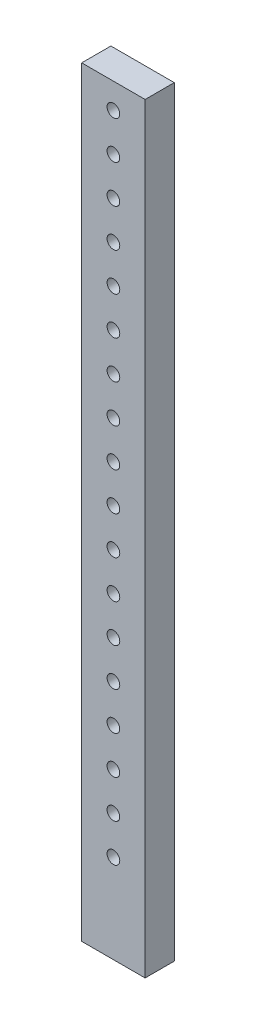
ISO-10303-21;
HEADER;
FILE_DESCRIPTION(('STEP AP214'),'2;1');
FILE_NAME('part.step','',(''),(''),'','','');
FILE_SCHEMA(('AUTOMOTIVE_DESIGN { 1 0 10303 214 1 1 1 1 }'));
ENDSEC;
DATA;
#1=APPLICATION_CONTEXT('core data for automotive mechanical design processes');
#2=APPLICATION_PROTOCOL_DEFINITION('international standard','automotive_design',2000,#1);
#3=PRODUCT_CONTEXT('',#1,'mechanical');
#4=PRODUCT('Part','Part','',(#3));
#5=PRODUCT_RELATED_PRODUCT_CATEGORY('part','',(#4));
#6=PRODUCT_DEFINITION_FORMATION('','',#4);
#7=PRODUCT_DEFINITION_CONTEXT('part definition',#1,'design');
#8=PRODUCT_DEFINITION('design','',#6,#7);
#9=PRODUCT_DEFINITION_SHAPE('','',#8);
#10=(LENGTH_UNIT() NAMED_UNIT(*) SI_UNIT(.MILLI.,.METRE.));
#11=(NAMED_UNIT(*) PLANE_ANGLE_UNIT() SI_UNIT($,.RADIAN.));
#12=(NAMED_UNIT(*) SI_UNIT($,.STERADIAN.) SOLID_ANGLE_UNIT());
#13=UNCERTAINTY_MEASURE_WITH_UNIT(LENGTH_MEASURE(1.E-05),#10,'distance_accuracy_value','');
#14=(GEOMETRIC_REPRESENTATION_CONTEXT(3) GLOBAL_UNCERTAINTY_ASSIGNED_CONTEXT((#13)) GLOBAL_UNIT_ASSIGNED_CONTEXT((#10,
#11,#12)) REPRESENTATION_CONTEXT('',''));
#15=CARTESIAN_POINT('',(0.,0.,0.));
#16=DIRECTION('',(0.,0.,1.));
#17=DIRECTION('',(1.,0.,0.));
#18=AXIS2_PLACEMENT_3D('',#15,#16,#17);
#19=CARTESIAN_POINT('',(0.,0.,23.));
#20=DIRECTION('',(0.,0.,1.));
#21=DIRECTION('',(1.,0.,0.));
#22=AXIS2_PLACEMENT_3D('',#19,#20,#21);
#23=PLANE('',#22);
#24=CARTESIAN_POINT('',(6.74691348156617E-12,-200.,23.));
#25=DIRECTION('',(0.,0.,1.));
#26=DIRECTION('',(1.,0.,0.));
#27=AXIS2_PLACEMENT_3D('',#24,#25,#26);
#28=CIRCLE('',#27,5.);
#29=CARTESIAN_POINT('',(5.00000000000675,-200.,23.));
#30=VERTEX_POINT('',#29);
#31=EDGE_CURVE('E204',#30,#30,#28,.T.);
#32=ORIENTED_EDGE('',*,*,#31,.F.);
#33=EDGE_LOOP('',(#32));
#34=FACE_BOUND('',#33,.T.);
#35=CARTESIAN_POINT('',(5.90528401984637E-12,-140.,23.));
#36=DIRECTION('',(0.,0.,1.));
#37=DIRECTION('',(1.,0.,0.));
#38=AXIS2_PLACEMENT_3D('',#35,#36,#37);
#39=CIRCLE('',#38,5.);
#40=CARTESIAN_POINT('',(5.00000000000591,-140.,23.));
#41=VERTEX_POINT('',#40);
#42=EDGE_CURVE('E192',#41,#41,#39,.T.);
#43=ORIENTED_EDGE('',*,*,#42,.F.);
#44=EDGE_LOOP('',(#43));
#45=FACE_BOUND('',#44,.T.);
#46=CARTESIAN_POINT('',(5.06365455812658E-12,-80.,23.));
#47=DIRECTION('',(0.,0.,1.));
#48=DIRECTION('',(1.,0.,0.));
#49=AXIS2_PLACEMENT_3D('',#46,#47,#48);
#50=CIRCLE('',#49,5.);
#51=CARTESIAN_POINT('',(5.00000000000507,-80.,23.));
#52=VERTEX_POINT('',#51);
#53=EDGE_CURVE('E180',#52,#52,#50,.T.);
#54=ORIENTED_EDGE('',*,*,#53,.F.);
#55=EDGE_LOOP('',(#54));
#56=FACE_BOUND('',#55,.T.);
#57=CARTESIAN_POINT('',(4.22202509640678E-12,-20.,23.));
#58=DIRECTION('',(0.,0.,1.));
#59=DIRECTION('',(1.,0.,0.));
#60=AXIS2_PLACEMENT_3D('',#57,#58,#59);
#61=CIRCLE('',#60,5.);
#62=CARTESIAN_POINT('',(5.00000000000423,-20.,23.));
#63=VERTEX_POINT('',#62);
#64=EDGE_CURVE('E168',#63,#63,#61,.T.);
#65=ORIENTED_EDGE('',*,*,#64,.F.);
#66=EDGE_LOOP('',(#65));
#67=FACE_BOUND('',#66,.T.);
#68=CARTESIAN_POINT('',(3.38039563468699E-12,40.,23.));
#69=DIRECTION('',(0.,0.,1.));
#70=DIRECTION('',(1.,0.,0.));
#71=AXIS2_PLACEMENT_3D('',#68,#69,#70);
#72=CIRCLE('',#71,5.);
#73=CARTESIAN_POINT('',(5.00000000000338,40.,23.));
#74=VERTEX_POINT('',#73);
#75=EDGE_CURVE('E156',#74,#74,#72,.T.);
#76=ORIENTED_EDGE('',*,*,#75,.F.);
#77=EDGE_LOOP('',(#76));
#78=FACE_BOUND('',#77,.T.);
#79=CARTESIAN_POINT('',(2.5387661729672E-12,100.,23.));
#80=DIRECTION('',(0.,0.,1.));
#81=DIRECTION('',(1.,0.,0.));
#82=AXIS2_PLACEMENT_3D('',#79,#80,#81);
#83=CIRCLE('',#82,5.);
#84=CARTESIAN_POINT('',(5.00000000000254,100.,23.));
#85=VERTEX_POINT('',#84);
#86=EDGE_CURVE('E144',#85,#85,#83,.T.);
#87=ORIENTED_EDGE('',*,*,#86,.F.);
#88=EDGE_LOOP('',(#87));
#89=FACE_BOUND('',#88,.T.);
#90=CARTESIAN_POINT('',(1.6971367112474E-12,160.,23.));
#91=DIRECTION('',(0.,0.,1.));
#92=DIRECTION('',(1.,0.,0.));
#93=AXIS2_PLACEMENT_3D('',#90,#91,#92);
#94=CIRCLE('',#93,5.);
#95=CARTESIAN_POINT('',(5.0000000000017,160.,23.));
#96=VERTEX_POINT('',#95);
#97=EDGE_CURVE('E132',#96,#96,#94,.T.);
#98=ORIENTED_EDGE('',*,*,#97,.F.);
#99=EDGE_LOOP('',(#98));
#100=FACE_BOUND('',#99,.T.);
#101=CARTESIAN_POINT('',(8.55507249527608E-13,220.,23.));
#102=DIRECTION('',(0.,0.,1.));
#103=DIRECTION('',(1.,0.,0.));
#104=AXIS2_PLACEMENT_3D('',#101,#102,#103);
#105=CIRCLE('',#104,5.);
#106=CARTESIAN_POINT('',(5.00000000000086,220.,23.));
#107=VERTEX_POINT('',#106);
#108=EDGE_CURVE('E120',#107,#107,#105,.T.);
#109=ORIENTED_EDGE('',*,*,#108,.F.);
#110=EDGE_LOOP('',(#109));
#111=FACE_BOUND('',#110,.T.);
#112=CARTESIAN_POINT('',(0.,280.,23.));
#113=DIRECTION('',(0.,0.,1.));
#114=DIRECTION('',(1.,0.,0.));
#115=AXIS2_PLACEMENT_3D('',#112,#113,#114);
#116=CIRCLE('',#115,5.);
#117=CARTESIAN_POINT('',(5.00000000000002,280.,23.));
#118=VERTEX_POINT('',#117);
#119=EDGE_CURVE('E99',#118,#118,#116,.T.);
#120=ORIENTED_EDGE('',*,*,#119,.F.);
#121=EDGE_LOOP('',(#120));
#122=FACE_BOUND('',#121,.T.);
#123=DIRECTION('',(0.,1.,0.));
#124=VECTOR('',#123,1.);
#125=CARTESIAN_POINT('',(25.,300.,23.));
#126=LINE('',#125,#124);
#127=CARTESIAN_POINT('',(25.,-300.,23.));
#128=VERTEX_POINT('',#127);
#129=CARTESIAN_POINT('',(25.,300.,23.));
#130=VERTEX_POINT('',#129);
#131=EDGE_CURVE('E84',#128,#130,#126,.T.);
#132=ORIENTED_EDGE('',*,*,#131,.T.);
#133=DIRECTION('',(-1.,0.,0.));
#134=VECTOR('',#133,1.);
#135=CARTESIAN_POINT('',(-25.,300.,23.));
#136=LINE('',#135,#134);
#137=CARTESIAN_POINT('',(-25.,300.,23.));
#138=VERTEX_POINT('',#137);
#139=EDGE_CURVE('E79',#130,#138,#136,.T.);
#140=ORIENTED_EDGE('',*,*,#139,.T.);
#141=DIRECTION('',(0.,-1.,0.));
#142=VECTOR('',#141,1.);
#143=CARTESIAN_POINT('',(-25.,300.,23.));
#144=LINE('',#143,#142);
#145=CARTESIAN_POINT('',(-25.,-300.,23.));
#146=VERTEX_POINT('',#145);
#147=EDGE_CURVE('E82',#138,#146,#144,.T.);
#148=ORIENTED_EDGE('',*,*,#147,.T.);
#149=DIRECTION('',(1.,0.,0.));
#150=VECTOR('',#149,1.);
#151=CARTESIAN_POINT('',(-25.,-300.,23.));
#152=LINE('',#151,#150);
#153=EDGE_CURVE('E49',#146,#128,#152,.T.);
#154=ORIENTED_EDGE('',*,*,#153,.T.);
#155=EDGE_LOOP('',(#132,#140,#148,#154));
#156=FACE_BOUND('',#155,.T.);
#157=CARTESIAN_POINT('',(4.34692518667711E-13,250.,23.));
#158=DIRECTION('',(0.,0.,1.));
#159=DIRECTION('',(1.,0.,0.));
#160=AXIS2_PLACEMENT_3D('',#157,#158,#159);
#161=CIRCLE('',#160,5.);
#162=CARTESIAN_POINT('',(5.00000000000043,250.,23.));
#163=VERTEX_POINT('',#162);
#164=EDGE_CURVE('E114',#163,#163,#161,.T.);
#165=ORIENTED_EDGE('',*,*,#164,.F.);
#166=EDGE_LOOP('',(#165));
#167=FACE_BOUND('',#166,.T.);
#168=CARTESIAN_POINT('',(1.27632198038751E-12,190.,23.));
#169=DIRECTION('',(0.,0.,1.));
#170=DIRECTION('',(1.,0.,0.));
#171=AXIS2_PLACEMENT_3D('',#168,#169,#170);
#172=CIRCLE('',#171,5.);
#173=CARTESIAN_POINT('',(5.00000000000128,190.,23.));
#174=VERTEX_POINT('',#173);
#175=EDGE_CURVE('E126',#174,#174,#172,.T.);
#176=ORIENTED_EDGE('',*,*,#175,.F.);
#177=EDGE_LOOP('',(#176));
#178=FACE_BOUND('',#177,.T.);
#179=CARTESIAN_POINT('',(2.1179514421073E-12,130.,23.));
#180=DIRECTION('',(0.,0.,1.));
#181=DIRECTION('',(1.,0.,0.));
#182=AXIS2_PLACEMENT_3D('',#179,#180,#181);
#183=CIRCLE('',#182,5.);
#184=CARTESIAN_POINT('',(5.00000000000212,130.,23.));
#185=VERTEX_POINT('',#184);
#186=EDGE_CURVE('E138',#185,#185,#183,.T.);
#187=ORIENTED_EDGE('',*,*,#186,.F.);
#188=EDGE_LOOP('',(#187));
#189=FACE_BOUND('',#188,.T.);
#190=CARTESIAN_POINT('',(2.95958090382709E-12,70.,23.));
#191=DIRECTION('',(0.,0.,1.));
#192=DIRECTION('',(1.,0.,0.));
#193=AXIS2_PLACEMENT_3D('',#190,#191,#192);
#194=CIRCLE('',#193,5.);
#195=CARTESIAN_POINT('',(5.00000000000296,70.,23.));
#196=VERTEX_POINT('',#195);
#197=EDGE_CURVE('E150',#196,#196,#194,.T.);
#198=ORIENTED_EDGE('',*,*,#197,.F.);
#199=EDGE_LOOP('',(#198));
#200=FACE_BOUND('',#199,.T.);
#201=CARTESIAN_POINT('',(3.80121036554689E-12,10.,23.));
#202=DIRECTION('',(0.,0.,1.));
#203=DIRECTION('',(1.,0.,0.));
#204=AXIS2_PLACEMENT_3D('',#201,#202,#203);
#205=CIRCLE('',#204,5.);
#206=CARTESIAN_POINT('',(5.0000000000038,10.,23.));
#207=VERTEX_POINT('',#206);
#208=EDGE_CURVE('E162',#207,#207,#205,.T.);
#209=ORIENTED_EDGE('',*,*,#208,.F.);
#210=EDGE_LOOP('',(#209));
#211=FACE_BOUND('',#210,.T.);
#212=CARTESIAN_POINT('',(4.64283982726668E-12,-50.,23.));
#213=DIRECTION('',(0.,0.,1.));
#214=DIRECTION('',(1.,0.,0.));
#215=AXIS2_PLACEMENT_3D('',#212,#213,#214);
#216=CIRCLE('',#215,5.);
#217=CARTESIAN_POINT('',(5.00000000000465,-50.,23.));
#218=VERTEX_POINT('',#217);
#219=EDGE_CURVE('E174',#218,#218,#216,.T.);
#220=ORIENTED_EDGE('',*,*,#219,.F.);
#221=EDGE_LOOP('',(#220));
#222=FACE_BOUND('',#221,.T.);
#223=CARTESIAN_POINT('',(5.48446928898647E-12,-110.,23.));
#224=DIRECTION('',(0.,0.,1.));
#225=DIRECTION('',(1.,0.,0.));
#226=AXIS2_PLACEMENT_3D('',#223,#224,#225);
#227=CIRCLE('',#226,5.);
#228=CARTESIAN_POINT('',(5.00000000000549,-110.,23.));
#229=VERTEX_POINT('',#228);
#230=EDGE_CURVE('E186',#229,#229,#227,.T.);
#231=ORIENTED_EDGE('',*,*,#230,.F.);
#232=EDGE_LOOP('',(#231));
#233=FACE_BOUND('',#232,.T.);
#234=CARTESIAN_POINT('',(6.32609875070627E-12,-170.,23.));
#235=DIRECTION('',(0.,0.,1.));
#236=DIRECTION('',(1.,0.,0.));
#237=AXIS2_PLACEMENT_3D('',#234,#235,#236);
#238=CIRCLE('',#237,5.);
#239=CARTESIAN_POINT('',(5.00000000000633,-170.,23.));
#240=VERTEX_POINT('',#239);
#241=EDGE_CURVE('E198',#240,#240,#238,.T.);
#242=ORIENTED_EDGE('',*,*,#241,.F.);
#243=EDGE_LOOP('',(#242));
#244=FACE_BOUND('',#243,.T.);
#245=CARTESIAN_POINT('',(7.16772821242606E-12,-230.,23.));
#246=DIRECTION('',(0.,0.,1.));
#247=DIRECTION('',(1.,0.,0.));
#248=AXIS2_PLACEMENT_3D('',#245,#246,#247);
#249=CIRCLE('',#248,5.);
#250=CARTESIAN_POINT('',(5.00000000000717,-230.,23.));
#251=VERTEX_POINT('',#250);
#252=EDGE_CURVE('E210',#251,#251,#249,.T.);
#253=ORIENTED_EDGE('',*,*,#252,.F.);
#254=EDGE_LOOP('',(#253));
#255=FACE_BOUND('',#254,.T.);
#256=ADVANCED_FACE('F32',(#34,#45,#56,#67,#78,#89,#100,#111,#122,#156,#167,#178,#189,#200,#211,
#222,#233,#244,#255),#23,.T.);
#257=CARTESIAN_POINT('',(0.,0.,0.));
#258=DIRECTION('',(0.,0.,1.));
#259=DIRECTION('',(1.,0.,0.));
#260=AXIS2_PLACEMENT_3D('',#257,#258,#259);
#261=PLANE('',#260);
#262=CARTESIAN_POINT('',(6.74691348156617E-12,-200.,0.));
#263=DIRECTION('',(0.,0.,1.));
#264=DIRECTION('',(1.,0.,0.));
#265=AXIS2_PLACEMENT_3D('',#262,#263,#264);
#266=CIRCLE('',#265,5.);
#267=CARTESIAN_POINT('',(5.00000000000675,-200.,0.));
#268=VERTEX_POINT('',#267);
#269=EDGE_CURVE('E207',#268,#268,#266,.T.);
#270=ORIENTED_EDGE('',*,*,#269,.T.);
#271=EDGE_LOOP('',(#270));
#272=FACE_BOUND('',#271,.T.);
#273=CARTESIAN_POINT('',(5.90528401984637E-12,-140.,0.));
#274=DIRECTION('',(0.,0.,1.));
#275=DIRECTION('',(1.,0.,0.));
#276=AXIS2_PLACEMENT_3D('',#273,#274,#275);
#277=CIRCLE('',#276,5.);
#278=CARTESIAN_POINT('',(5.00000000000591,-140.,0.));
#279=VERTEX_POINT('',#278);
#280=EDGE_CURVE('E195',#279,#279,#277,.T.);
#281=ORIENTED_EDGE('',*,*,#280,.T.);
#282=EDGE_LOOP('',(#281));
#283=FACE_BOUND('',#282,.T.);
#284=CARTESIAN_POINT('',(5.06365455812658E-12,-80.,0.));
#285=DIRECTION('',(0.,0.,1.));
#286=DIRECTION('',(1.,0.,0.));
#287=AXIS2_PLACEMENT_3D('',#284,#285,#286);
#288=CIRCLE('',#287,5.);
#289=CARTESIAN_POINT('',(5.00000000000507,-80.,0.));
#290=VERTEX_POINT('',#289);
#291=EDGE_CURVE('E183',#290,#290,#288,.T.);
#292=ORIENTED_EDGE('',*,*,#291,.T.);
#293=EDGE_LOOP('',(#292));
#294=FACE_BOUND('',#293,.T.);
#295=CARTESIAN_POINT('',(4.22202509640678E-12,-20.,0.));
#296=DIRECTION('',(0.,0.,1.));
#297=DIRECTION('',(1.,0.,0.));
#298=AXIS2_PLACEMENT_3D('',#295,#296,#297);
#299=CIRCLE('',#298,5.);
#300=CARTESIAN_POINT('',(5.00000000000423,-20.,0.));
#301=VERTEX_POINT('',#300);
#302=EDGE_CURVE('E171',#301,#301,#299,.T.);
#303=ORIENTED_EDGE('',*,*,#302,.T.);
#304=EDGE_LOOP('',(#303));
#305=FACE_BOUND('',#304,.T.);
#306=CARTESIAN_POINT('',(3.38039563468699E-12,40.,0.));
#307=DIRECTION('',(0.,0.,1.));
#308=DIRECTION('',(1.,0.,0.));
#309=AXIS2_PLACEMENT_3D('',#306,#307,#308);
#310=CIRCLE('',#309,5.);
#311=CARTESIAN_POINT('',(5.00000000000338,40.,0.));
#312=VERTEX_POINT('',#311);
#313=EDGE_CURVE('E159',#312,#312,#310,.T.);
#314=ORIENTED_EDGE('',*,*,#313,.T.);
#315=EDGE_LOOP('',(#314));
#316=FACE_BOUND('',#315,.T.);
#317=CARTESIAN_POINT('',(2.5387661729672E-12,100.,0.));
#318=DIRECTION('',(0.,0.,1.));
#319=DIRECTION('',(1.,0.,0.));
#320=AXIS2_PLACEMENT_3D('',#317,#318,#319);
#321=CIRCLE('',#320,5.);
#322=CARTESIAN_POINT('',(5.00000000000254,100.,0.));
#323=VERTEX_POINT('',#322);
#324=EDGE_CURVE('E147',#323,#323,#321,.T.);
#325=ORIENTED_EDGE('',*,*,#324,.T.);
#326=EDGE_LOOP('',(#325));
#327=FACE_BOUND('',#326,.T.);
#328=CARTESIAN_POINT('',(1.6971367112474E-12,160.,0.));
#329=DIRECTION('',(0.,0.,1.));
#330=DIRECTION('',(1.,0.,0.));
#331=AXIS2_PLACEMENT_3D('',#328,#329,#330);
#332=CIRCLE('',#331,5.);
#333=CARTESIAN_POINT('',(5.0000000000017,160.,0.));
#334=VERTEX_POINT('',#333);
#335=EDGE_CURVE('E135',#334,#334,#332,.T.);
#336=ORIENTED_EDGE('',*,*,#335,.T.);
#337=EDGE_LOOP('',(#336));
#338=FACE_BOUND('',#337,.T.);
#339=CARTESIAN_POINT('',(8.55507249527608E-13,220.,0.));
#340=DIRECTION('',(0.,0.,1.));
#341=DIRECTION('',(1.,0.,0.));
#342=AXIS2_PLACEMENT_3D('',#339,#340,#341);
#343=CIRCLE('',#342,5.);
#344=CARTESIAN_POINT('',(5.00000000000086,220.,0.));
#345=VERTEX_POINT('',#344);
#346=EDGE_CURVE('E123',#345,#345,#343,.T.);
#347=ORIENTED_EDGE('',*,*,#346,.T.);
#348=EDGE_LOOP('',(#347));
#349=FACE_BOUND('',#348,.T.);
#350=CARTESIAN_POINT('',(0.,280.,0.));
#351=DIRECTION('',(0.,0.,1.));
#352=DIRECTION('',(1.,0.,0.));
#353=AXIS2_PLACEMENT_3D('',#350,#351,#352);
#354=CIRCLE('',#353,5.);
#355=CARTESIAN_POINT('',(5.00000000000002,280.,0.));
#356=VERTEX_POINT('',#355);
#357=EDGE_CURVE('E111',#356,#356,#354,.T.);
#358=ORIENTED_EDGE('',*,*,#357,.T.);
#359=EDGE_LOOP('',(#358));
#360=FACE_BOUND('',#359,.T.);
#361=DIRECTION('',(0.,1.,0.));
#362=VECTOR('',#361,1.);
#363=CARTESIAN_POINT('',(25.,300.,0.));
#364=LINE('',#363,#362);
#365=CARTESIAN_POINT('',(25.,-300.,0.));
#366=VERTEX_POINT('',#365);
#367=CARTESIAN_POINT('',(25.,300.,0.));
#368=VERTEX_POINT('',#367);
#369=EDGE_CURVE('E96',#366,#368,#364,.T.);
#370=ORIENTED_EDGE('',*,*,#369,.F.);
#371=DIRECTION('',(1.,0.,0.));
#372=VECTOR('',#371,1.);
#373=CARTESIAN_POINT('',(-25.,-300.,0.));
#374=LINE('',#373,#372);
#375=CARTESIAN_POINT('',(-25.,-300.,0.));
#376=VERTEX_POINT('',#375);
#377=EDGE_CURVE('E72',#376,#366,#374,.T.);
#378=ORIENTED_EDGE('',*,*,#377,.F.);
#379=DIRECTION('',(0.,-1.,0.));
#380=VECTOR('',#379,1.);
#381=CARTESIAN_POINT('',(-25.,300.,0.));
#382=LINE('',#381,#380);
#383=CARTESIAN_POINT('',(-25.,300.,0.));
#384=VERTEX_POINT('',#383);
#385=EDGE_CURVE('E66',#384,#376,#382,.T.);
#386=ORIENTED_EDGE('',*,*,#385,.F.);
#387=DIRECTION('',(-1.,0.,0.));
#388=VECTOR('',#387,1.);
#389=CARTESIAN_POINT('',(-25.,300.,0.));
#390=LINE('',#389,#388);
#391=EDGE_CURVE('E88',#368,#384,#390,.T.);
#392=ORIENTED_EDGE('',*,*,#391,.F.);
#393=EDGE_LOOP('',(#370,#378,#386,#392));
#394=FACE_BOUND('',#393,.T.);
#395=CARTESIAN_POINT('',(4.34692518667711E-13,250.,0.));
#396=DIRECTION('',(0.,0.,1.));
#397=DIRECTION('',(1.,0.,0.));
#398=AXIS2_PLACEMENT_3D('',#395,#396,#397);
#399=CIRCLE('',#398,5.);
#400=CARTESIAN_POINT('',(5.00000000000043,250.,0.));
#401=VERTEX_POINT('',#400);
#402=EDGE_CURVE('E117',#401,#401,#399,.T.);
#403=ORIENTED_EDGE('',*,*,#402,.T.);
#404=EDGE_LOOP('',(#403));
#405=FACE_BOUND('',#404,.T.);
#406=CARTESIAN_POINT('',(1.27632198038751E-12,190.,0.));
#407=DIRECTION('',(0.,0.,1.));
#408=DIRECTION('',(1.,0.,0.));
#409=AXIS2_PLACEMENT_3D('',#406,#407,#408);
#410=CIRCLE('',#409,5.);
#411=CARTESIAN_POINT('',(5.00000000000128,190.,0.));
#412=VERTEX_POINT('',#411);
#413=EDGE_CURVE('E129',#412,#412,#410,.T.);
#414=ORIENTED_EDGE('',*,*,#413,.T.);
#415=EDGE_LOOP('',(#414));
#416=FACE_BOUND('',#415,.T.);
#417=CARTESIAN_POINT('',(2.1179514421073E-12,130.,0.));
#418=DIRECTION('',(0.,0.,1.));
#419=DIRECTION('',(1.,0.,0.));
#420=AXIS2_PLACEMENT_3D('',#417,#418,#419);
#421=CIRCLE('',#420,5.);
#422=CARTESIAN_POINT('',(5.00000000000212,130.,0.));
#423=VERTEX_POINT('',#422);
#424=EDGE_CURVE('E141',#423,#423,#421,.T.);
#425=ORIENTED_EDGE('',*,*,#424,.T.);
#426=EDGE_LOOP('',(#425));
#427=FACE_BOUND('',#426,.T.);
#428=CARTESIAN_POINT('',(2.95958090382709E-12,70.,0.));
#429=DIRECTION('',(0.,0.,1.));
#430=DIRECTION('',(1.,0.,0.));
#431=AXIS2_PLACEMENT_3D('',#428,#429,#430);
#432=CIRCLE('',#431,5.);
#433=CARTESIAN_POINT('',(5.00000000000296,70.,0.));
#434=VERTEX_POINT('',#433);
#435=EDGE_CURVE('E153',#434,#434,#432,.T.);
#436=ORIENTED_EDGE('',*,*,#435,.T.);
#437=EDGE_LOOP('',(#436));
#438=FACE_BOUND('',#437,.T.);
#439=CARTESIAN_POINT('',(3.80121036554689E-12,10.,0.));
#440=DIRECTION('',(0.,0.,1.));
#441=DIRECTION('',(1.,0.,0.));
#442=AXIS2_PLACEMENT_3D('',#439,#440,#441);
#443=CIRCLE('',#442,5.);
#444=CARTESIAN_POINT('',(5.0000000000038,10.,0.));
#445=VERTEX_POINT('',#444);
#446=EDGE_CURVE('E165',#445,#445,#443,.T.);
#447=ORIENTED_EDGE('',*,*,#446,.T.);
#448=EDGE_LOOP('',(#447));
#449=FACE_BOUND('',#448,.T.);
#450=CARTESIAN_POINT('',(4.64283982726668E-12,-50.,0.));
#451=DIRECTION('',(0.,0.,1.));
#452=DIRECTION('',(1.,0.,0.));
#453=AXIS2_PLACEMENT_3D('',#450,#451,#452);
#454=CIRCLE('',#453,5.);
#455=CARTESIAN_POINT('',(5.00000000000465,-50.,0.));
#456=VERTEX_POINT('',#455);
#457=EDGE_CURVE('E177',#456,#456,#454,.T.);
#458=ORIENTED_EDGE('',*,*,#457,.T.);
#459=EDGE_LOOP('',(#458));
#460=FACE_BOUND('',#459,.T.);
#461=CARTESIAN_POINT('',(5.48446928898647E-12,-110.,0.));
#462=DIRECTION('',(0.,0.,1.));
#463=DIRECTION('',(1.,0.,0.));
#464=AXIS2_PLACEMENT_3D('',#461,#462,#463);
#465=CIRCLE('',#464,5.);
#466=CARTESIAN_POINT('',(5.00000000000549,-110.,0.));
#467=VERTEX_POINT('',#466);
#468=EDGE_CURVE('E189',#467,#467,#465,.T.);
#469=ORIENTED_EDGE('',*,*,#468,.T.);
#470=EDGE_LOOP('',(#469));
#471=FACE_BOUND('',#470,.T.);
#472=CARTESIAN_POINT('',(6.32609875070627E-12,-170.,0.));
#473=DIRECTION('',(0.,0.,1.));
#474=DIRECTION('',(1.,0.,0.));
#475=AXIS2_PLACEMENT_3D('',#472,#473,#474);
#476=CIRCLE('',#475,5.);
#477=CARTESIAN_POINT('',(5.00000000000633,-170.,0.));
#478=VERTEX_POINT('',#477);
#479=EDGE_CURVE('E201',#478,#478,#476,.T.);
#480=ORIENTED_EDGE('',*,*,#479,.T.);
#481=EDGE_LOOP('',(#480));
#482=FACE_BOUND('',#481,.T.);
#483=CARTESIAN_POINT('',(7.16772821242606E-12,-230.,0.));
#484=DIRECTION('',(0.,0.,1.));
#485=DIRECTION('',(1.,0.,0.));
#486=AXIS2_PLACEMENT_3D('',#483,#484,#485);
#487=CIRCLE('',#486,5.);
#488=CARTESIAN_POINT('',(5.00000000000717,-230.,0.));
#489=VERTEX_POINT('',#488);
#490=EDGE_CURVE('E213',#489,#489,#487,.T.);
#491=ORIENTED_EDGE('',*,*,#490,.T.);
#492=EDGE_LOOP('',(#491));
#493=FACE_BOUND('',#492,.T.);
#494=ADVANCED_FACE('F107',(#272,#283,#294,#305,#316,#327,#338,#349,#360,#394,#405,#416,#427,
#438,#449,#460,#471,#482,#493),#261,.F.);
#495=CARTESIAN_POINT('',(25.,300.,23.));
#496=DIRECTION('',(-1.,0.,0.));
#497=DIRECTION('',(0.,-1.,0.));
#498=AXIS2_PLACEMENT_3D('',#495,#496,#497);
#499=PLANE('',#498);
#500=ORIENTED_EDGE('',*,*,#369,.T.);
#501=DIRECTION('',(0.,0.,-1.));
#502=VECTOR('',#501,1.);
#503=CARTESIAN_POINT('',(25.,300.,23.));
#504=LINE('',#503,#502);
#505=EDGE_CURVE('E11',#130,#368,#504,.T.);
#506=ORIENTED_EDGE('',*,*,#505,.F.);
#507=ORIENTED_EDGE('',*,*,#131,.F.);
#508=DIRECTION('',(0.,0.,-1.));
#509=VECTOR('',#508,1.);
#510=CARTESIAN_POINT('',(25.,-300.,23.));
#511=LINE('',#510,#509);
#512=EDGE_CURVE('E92',#128,#366,#511,.T.);
#513=ORIENTED_EDGE('',*,*,#512,.T.);
#514=EDGE_LOOP('',(#500,#506,#507,#513));
#515=FACE_BOUND('',#514,.T.);
#516=ADVANCED_FACE('F34',(#515),#499,.F.);
#517=CARTESIAN_POINT('',(-25.,300.,23.));
#518=DIRECTION('',(0.,-1.,0.));
#519=DIRECTION('',(0.,0.,-1.));
#520=AXIS2_PLACEMENT_3D('',#517,#518,#519);
#521=PLANE('',#520);
#522=ORIENTED_EDGE('',*,*,#391,.T.);
#523=DIRECTION('',(0.,0.,-1.));
#524=VECTOR('',#523,1.);
#525=CARTESIAN_POINT('',(-25.,300.,23.));
#526=LINE('',#525,#524);
#527=EDGE_CURVE('E41',#138,#384,#526,.T.);
#528=ORIENTED_EDGE('',*,*,#527,.F.);
#529=ORIENTED_EDGE('',*,*,#139,.F.);
#530=ORIENTED_EDGE('',*,*,#505,.T.);
#531=EDGE_LOOP('',(#522,#528,#529,#530));
#532=FACE_BOUND('',#531,.T.);
#533=ADVANCED_FACE('F87',(#532),#521,.F.);
#534=CARTESIAN_POINT('',(-25.,300.,23.));
#535=DIRECTION('',(1.,0.,0.));
#536=DIRECTION('',(0.,1.,0.));
#537=AXIS2_PLACEMENT_3D('',#534,#535,#536);
#538=PLANE('',#537);
#539=ORIENTED_EDGE('',*,*,#385,.T.);
#540=DIRECTION('',(0.,0.,-1.));
#541=VECTOR('',#540,1.);
#542=CARTESIAN_POINT('',(-25.,-300.,23.));
#543=LINE('',#542,#541);
#544=EDGE_CURVE('E89',#146,#376,#543,.T.);
#545=ORIENTED_EDGE('',*,*,#544,.F.);
#546=ORIENTED_EDGE('',*,*,#147,.F.);
#547=ORIENTED_EDGE('',*,*,#527,.T.);
#548=EDGE_LOOP('',(#539,#545,#546,#547));
#549=FACE_BOUND('',#548,.T.);
#550=ADVANCED_FACE('F90',(#549),#538,.F.);
#551=CARTESIAN_POINT('',(-25.,-300.,23.));
#552=DIRECTION('',(0.,1.,0.));
#553=DIRECTION('',(0.,0.,1.));
#554=AXIS2_PLACEMENT_3D('',#551,#552,#553);
#555=PLANE('',#554);
#556=ORIENTED_EDGE('',*,*,#377,.T.);
#557=ORIENTED_EDGE('',*,*,#512,.F.);
#558=ORIENTED_EDGE('',*,*,#153,.F.);
#559=ORIENTED_EDGE('',*,*,#544,.T.);
#560=EDGE_LOOP('',(#556,#557,#558,#559));
#561=FACE_BOUND('',#560,.T.);
#562=ADVANCED_FACE('F104',(#561),#555,.F.);
#563=CARTESIAN_POINT('',(0.,280.,23.));
#564=DIRECTION('',(0.,0.,-1.));
#565=DIRECTION('',(-1.,0.,0.));
#566=AXIS2_PLACEMENT_3D('',#563,#564,#565);
#567=CYLINDRICAL_SURFACE('',#566,5.);
#568=ORIENTED_EDGE('',*,*,#119,.T.);
#569=EDGE_LOOP('',(#568));
#570=FACE_BOUND('',#569,.T.);
#571=ORIENTED_EDGE('',*,*,#357,.F.);
#572=EDGE_LOOP('',(#571));
#573=FACE_BOUND('',#572,.T.);
#574=ADVANCED_FACE('F233',(#570,#573),#567,.F.);
#575=CARTESIAN_POINT('',(4.34692518667711E-13,250.,23.));
#576=DIRECTION('',(0.,0.,-1.));
#577=DIRECTION('',(-1.,0.,0.));
#578=AXIS2_PLACEMENT_3D('',#575,#576,#577);
#579=CYLINDRICAL_SURFACE('',#578,5.);
#580=ORIENTED_EDGE('',*,*,#164,.T.);
#581=EDGE_LOOP('',(#580));
#582=FACE_BOUND('',#581,.T.);
#583=ORIENTED_EDGE('',*,*,#402,.F.);
#584=EDGE_LOOP('',(#583));
#585=FACE_BOUND('',#584,.T.);
#586=ADVANCED_FACE('F279',(#582,#585),#579,.F.);
#587=CARTESIAN_POINT('',(8.55507249527608E-13,220.,23.));
#588=DIRECTION('',(0.,0.,-1.));
#589=DIRECTION('',(-1.,0.,0.));
#590=AXIS2_PLACEMENT_3D('',#587,#588,#589);
#591=CYLINDRICAL_SURFACE('',#590,5.);
#592=ORIENTED_EDGE('',*,*,#108,.T.);
#593=EDGE_LOOP('',(#592));
#594=FACE_BOUND('',#593,.T.);
#595=ORIENTED_EDGE('',*,*,#346,.F.);
#596=EDGE_LOOP('',(#595));
#597=FACE_BOUND('',#596,.T.);
#598=ADVANCED_FACE('F287',(#594,#597),#591,.F.);
#599=CARTESIAN_POINT('',(1.27632198038751E-12,190.,23.));
#600=DIRECTION('',(0.,0.,-1.));
#601=DIRECTION('',(-1.,0.,0.));
#602=AXIS2_PLACEMENT_3D('',#599,#600,#601);
#603=CYLINDRICAL_SURFACE('',#602,5.);
#604=ORIENTED_EDGE('',*,*,#175,.T.);
#605=EDGE_LOOP('',(#604));
#606=FACE_BOUND('',#605,.T.);
#607=ORIENTED_EDGE('',*,*,#413,.F.);
#608=EDGE_LOOP('',(#607));
#609=FACE_BOUND('',#608,.T.);
#610=ADVANCED_FACE('F295',(#606,#609),#603,.F.);
#611=CARTESIAN_POINT('',(1.6971367112474E-12,160.,23.));
#612=DIRECTION('',(0.,0.,-1.));
#613=DIRECTION('',(-1.,0.,0.));
#614=AXIS2_PLACEMENT_3D('',#611,#612,#613);
#615=CYLINDRICAL_SURFACE('',#614,5.);
#616=ORIENTED_EDGE('',*,*,#97,.T.);
#617=EDGE_LOOP('',(#616));
#618=FACE_BOUND('',#617,.T.);
#619=ORIENTED_EDGE('',*,*,#335,.F.);
#620=EDGE_LOOP('',(#619));
#621=FACE_BOUND('',#620,.T.);
#622=ADVANCED_FACE('F304',(#618,#621),#615,.F.);
#623=CARTESIAN_POINT('',(2.1179514421073E-12,130.,23.));
#624=DIRECTION('',(0.,0.,-1.));
#625=DIRECTION('',(-1.,0.,0.));
#626=AXIS2_PLACEMENT_3D('',#623,#624,#625);
#627=CYLINDRICAL_SURFACE('',#626,5.);
#628=ORIENTED_EDGE('',*,*,#186,.T.);
#629=EDGE_LOOP('',(#628));
#630=FACE_BOUND('',#629,.T.);
#631=ORIENTED_EDGE('',*,*,#424,.F.);
#632=EDGE_LOOP('',(#631));
#633=FACE_BOUND('',#632,.T.);
#634=ADVANCED_FACE('F313',(#630,#633),#627,.F.);
#635=CARTESIAN_POINT('',(2.5387661729672E-12,100.,23.));
#636=DIRECTION('',(0.,0.,-1.));
#637=DIRECTION('',(-1.,0.,0.));
#638=AXIS2_PLACEMENT_3D('',#635,#636,#637);
#639=CYLINDRICAL_SURFACE('',#638,5.);
#640=ORIENTED_EDGE('',*,*,#86,.T.);
#641=EDGE_LOOP('',(#640));
#642=FACE_BOUND('',#641,.T.);
#643=ORIENTED_EDGE('',*,*,#324,.F.);
#644=EDGE_LOOP('',(#643));
#645=FACE_BOUND('',#644,.T.);
#646=ADVANCED_FACE('F322',(#642,#645),#639,.F.);
#647=CARTESIAN_POINT('',(2.95958090382709E-12,70.,23.));
#648=DIRECTION('',(0.,0.,-1.));
#649=DIRECTION('',(-1.,0.,0.));
#650=AXIS2_PLACEMENT_3D('',#647,#648,#649);
#651=CYLINDRICAL_SURFACE('',#650,5.);
#652=ORIENTED_EDGE('',*,*,#197,.T.);
#653=EDGE_LOOP('',(#652));
#654=FACE_BOUND('',#653,.T.);
#655=ORIENTED_EDGE('',*,*,#435,.F.);
#656=EDGE_LOOP('',(#655));
#657=FACE_BOUND('',#656,.T.);
#658=ADVANCED_FACE('F331',(#654,#657),#651,.F.);
#659=CARTESIAN_POINT('',(3.38039563468699E-12,40.,23.));
#660=DIRECTION('',(0.,0.,-1.));
#661=DIRECTION('',(-1.,0.,0.));
#662=AXIS2_PLACEMENT_3D('',#659,#660,#661);
#663=CYLINDRICAL_SURFACE('',#662,5.);
#664=ORIENTED_EDGE('',*,*,#75,.T.);
#665=EDGE_LOOP('',(#664));
#666=FACE_BOUND('',#665,.T.);
#667=ORIENTED_EDGE('',*,*,#313,.F.);
#668=EDGE_LOOP('',(#667));
#669=FACE_BOUND('',#668,.T.);
#670=ADVANCED_FACE('F340',(#666,#669),#663,.F.);
#671=CARTESIAN_POINT('',(3.80121036554689E-12,10.,23.));
#672=DIRECTION('',(0.,0.,-1.));
#673=DIRECTION('',(-1.,0.,0.));
#674=AXIS2_PLACEMENT_3D('',#671,#672,#673);
#675=CYLINDRICAL_SURFACE('',#674,5.);
#676=ORIENTED_EDGE('',*,*,#208,.T.);
#677=EDGE_LOOP('',(#676));
#678=FACE_BOUND('',#677,.T.);
#679=ORIENTED_EDGE('',*,*,#446,.F.);
#680=EDGE_LOOP('',(#679));
#681=FACE_BOUND('',#680,.T.);
#682=ADVANCED_FACE('F349',(#678,#681),#675,.F.);
#683=CARTESIAN_POINT('',(4.22202509640678E-12,-20.,23.));
#684=DIRECTION('',(0.,0.,-1.));
#685=DIRECTION('',(-1.,0.,0.));
#686=AXIS2_PLACEMENT_3D('',#683,#684,#685);
#687=CYLINDRICAL_SURFACE('',#686,5.);
#688=ORIENTED_EDGE('',*,*,#64,.T.);
#689=EDGE_LOOP('',(#688));
#690=FACE_BOUND('',#689,.T.);
#691=ORIENTED_EDGE('',*,*,#302,.F.);
#692=EDGE_LOOP('',(#691));
#693=FACE_BOUND('',#692,.T.);
#694=ADVANCED_FACE('F358',(#690,#693),#687,.F.);
#695=CARTESIAN_POINT('',(4.64283982726668E-12,-50.,23.));
#696=DIRECTION('',(0.,0.,-1.));
#697=DIRECTION('',(-1.,0.,0.));
#698=AXIS2_PLACEMENT_3D('',#695,#696,#697);
#699=CYLINDRICAL_SURFACE('',#698,5.);
#700=ORIENTED_EDGE('',*,*,#219,.T.);
#701=EDGE_LOOP('',(#700));
#702=FACE_BOUND('',#701,.T.);
#703=ORIENTED_EDGE('',*,*,#457,.F.);
#704=EDGE_LOOP('',(#703));
#705=FACE_BOUND('',#704,.T.);
#706=ADVANCED_FACE('F367',(#702,#705),#699,.F.);
#707=CARTESIAN_POINT('',(5.06365455812658E-12,-80.,23.));
#708=DIRECTION('',(0.,0.,-1.));
#709=DIRECTION('',(-1.,0.,0.));
#710=AXIS2_PLACEMENT_3D('',#707,#708,#709);
#711=CYLINDRICAL_SURFACE('',#710,5.);
#712=ORIENTED_EDGE('',*,*,#53,.T.);
#713=EDGE_LOOP('',(#712));
#714=FACE_BOUND('',#713,.T.);
#715=ORIENTED_EDGE('',*,*,#291,.F.);
#716=EDGE_LOOP('',(#715));
#717=FACE_BOUND('',#716,.T.);
#718=ADVANCED_FACE('F376',(#714,#717),#711,.F.);
#719=CARTESIAN_POINT('',(5.48446928898647E-12,-110.,23.));
#720=DIRECTION('',(0.,0.,-1.));
#721=DIRECTION('',(-1.,0.,0.));
#722=AXIS2_PLACEMENT_3D('',#719,#720,#721);
#723=CYLINDRICAL_SURFACE('',#722,5.);
#724=ORIENTED_EDGE('',*,*,#230,.T.);
#725=EDGE_LOOP('',(#724));
#726=FACE_BOUND('',#725,.T.);
#727=ORIENTED_EDGE('',*,*,#468,.F.);
#728=EDGE_LOOP('',(#727));
#729=FACE_BOUND('',#728,.T.);
#730=ADVANCED_FACE('F385',(#726,#729),#723,.F.);
#731=CARTESIAN_POINT('',(5.90528401984637E-12,-140.,23.));
#732=DIRECTION('',(0.,0.,-1.));
#733=DIRECTION('',(-1.,0.,0.));
#734=AXIS2_PLACEMENT_3D('',#731,#732,#733);
#735=CYLINDRICAL_SURFACE('',#734,5.);
#736=ORIENTED_EDGE('',*,*,#42,.T.);
#737=EDGE_LOOP('',(#736));
#738=FACE_BOUND('',#737,.T.);
#739=ORIENTED_EDGE('',*,*,#280,.F.);
#740=EDGE_LOOP('',(#739));
#741=FACE_BOUND('',#740,.T.);
#742=ADVANCED_FACE('F394',(#738,#741),#735,.F.);
#743=CARTESIAN_POINT('',(6.32609875070627E-12,-170.,23.));
#744=DIRECTION('',(0.,0.,-1.));
#745=DIRECTION('',(-1.,0.,0.));
#746=AXIS2_PLACEMENT_3D('',#743,#744,#745);
#747=CYLINDRICAL_SURFACE('',#746,5.);
#748=ORIENTED_EDGE('',*,*,#241,.T.);
#749=EDGE_LOOP('',(#748));
#750=FACE_BOUND('',#749,.T.);
#751=ORIENTED_EDGE('',*,*,#479,.F.);
#752=EDGE_LOOP('',(#751));
#753=FACE_BOUND('',#752,.T.);
#754=ADVANCED_FACE('F403',(#750,#753),#747,.F.);
#755=CARTESIAN_POINT('',(6.74691348156617E-12,-200.,23.));
#756=DIRECTION('',(0.,0.,-1.));
#757=DIRECTION('',(-1.,0.,0.));
#758=AXIS2_PLACEMENT_3D('',#755,#756,#757);
#759=CYLINDRICAL_SURFACE('',#758,5.);
#760=ORIENTED_EDGE('',*,*,#31,.T.);
#761=EDGE_LOOP('',(#760));
#762=FACE_BOUND('',#761,.T.);
#763=ORIENTED_EDGE('',*,*,#269,.F.);
#764=EDGE_LOOP('',(#763));
#765=FACE_BOUND('',#764,.T.);
#766=ADVANCED_FACE('F412',(#762,#765),#759,.F.);
#767=CARTESIAN_POINT('',(7.16772821242606E-12,-230.,23.));
#768=DIRECTION('',(0.,0.,-1.));
#769=DIRECTION('',(-1.,0.,0.));
#770=AXIS2_PLACEMENT_3D('',#767,#768,#769);
#771=CYLINDRICAL_SURFACE('',#770,5.);
#772=ORIENTED_EDGE('',*,*,#252,.T.);
#773=EDGE_LOOP('',(#772));
#774=FACE_BOUND('',#773,.T.);
#775=ORIENTED_EDGE('',*,*,#490,.F.);
#776=EDGE_LOOP('',(#775));
#777=FACE_BOUND('',#776,.T.);
#778=ADVANCED_FACE('F219',(#774,#777),#771,.F.);
#779=CLOSED_SHELL('',(#256,#494,#516,#533,#550,#562,#574,#586,#598,#610,#622,#634,#646,#658,
#670,#682,#694,#706,#718,#730,#742,#754,#766,#778));
#780=MANIFOLD_SOLID_BREP('B2',#779);
#781=ADVANCED_BREP_SHAPE_REPRESENTATION('',(#18,#780),#14);
#782=SHAPE_DEFINITION_REPRESENTATION(#9,#781);
ENDSEC;
END-ISO-10303-21;
